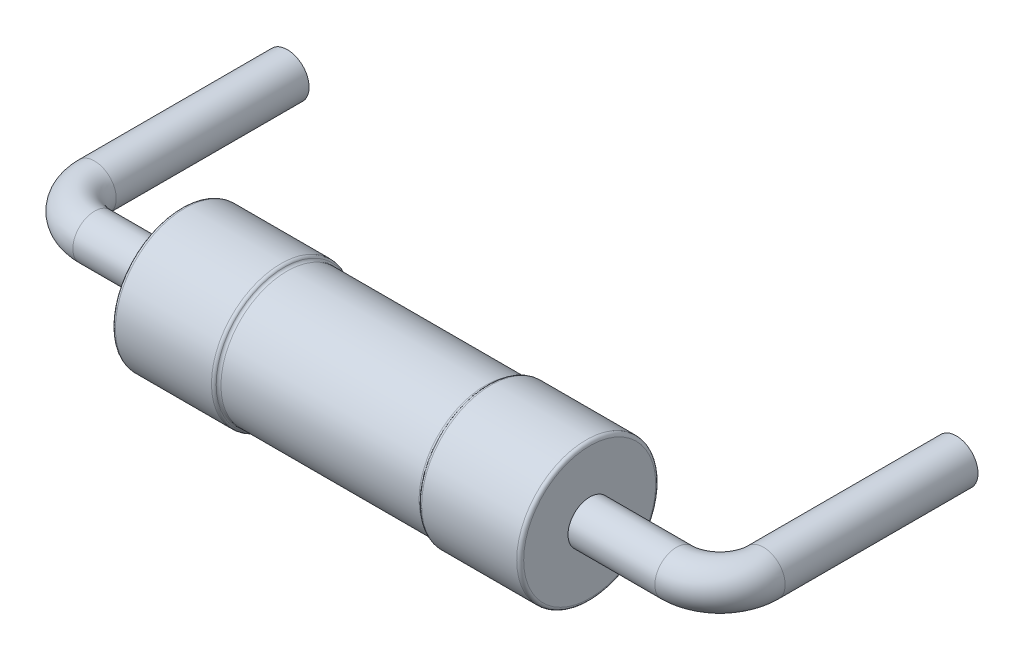
ISO-10303-21;
HEADER;
FILE_DESCRIPTION(('STEP AP214'),'2;1');
FILE_NAME('part.step','',(''),(''),'','','');
FILE_SCHEMA(('AUTOMOTIVE_DESIGN { 1 0 10303 214 1 1 1 1 }'));
ENDSEC;
DATA;
#1=APPLICATION_CONTEXT('core data for automotive mechanical design processes');
#2=APPLICATION_PROTOCOL_DEFINITION('international standard','automotive_design',2000,#1);
#3=PRODUCT_CONTEXT('',#1,'mechanical');
#4=PRODUCT('Part','Part','',(#3));
#5=PRODUCT_RELATED_PRODUCT_CATEGORY('part','',(#4));
#6=PRODUCT_DEFINITION_FORMATION('','',#4);
#7=PRODUCT_DEFINITION_CONTEXT('part definition',#1,'design');
#8=PRODUCT_DEFINITION('design','',#6,#7);
#9=PRODUCT_DEFINITION_SHAPE('','',#8);
#10=(LENGTH_UNIT() NAMED_UNIT(*) SI_UNIT(.MILLI.,.METRE.));
#11=(NAMED_UNIT(*) PLANE_ANGLE_UNIT() SI_UNIT($,.RADIAN.));
#12=(NAMED_UNIT(*) SI_UNIT($,.STERADIAN.) SOLID_ANGLE_UNIT());
#13=UNCERTAINTY_MEASURE_WITH_UNIT(LENGTH_MEASURE(1.E-05),#10,'distance_accuracy_value','');
#14=(GEOMETRIC_REPRESENTATION_CONTEXT(3) GLOBAL_UNCERTAINTY_ASSIGNED_CONTEXT((#13)) GLOBAL_UNIT_ASSIGNED_CONTEXT((#10,
#11,#12)) REPRESENTATION_CONTEXT('',''));
#15=CARTESIAN_POINT('',(0.,0.,0.));
#16=DIRECTION('',(0.,0.,1.));
#17=DIRECTION('',(1.,0.,0.));
#18=AXIS2_PLACEMENT_3D('',#15,#16,#17);
#19=CARTESIAN_POINT('',(3.85,0.,-0.809999999999999));
#20=DIRECTION('',(0.,0.,-1.));
#21=DIRECTION('',(0.,-1.,0.));
#22=AXIS2_PLACEMENT_3D('',#19,#20,#21);
#23=CYLINDRICAL_SURFACE('',#22,0.25);
#24=CARTESIAN_POINT('',(3.85,0.,0.3));
#25=DIRECTION('',(0.,0.,-1.));
#26=DIRECTION('',(0.,-1.,0.));
#27=AXIS2_PLACEMENT_3D('',#24,#25,#26);
#28=CIRCLE('',#27,0.25);
#29=CARTESIAN_POINT('',(4.1,0.,0.3));
#30=VERTEX_POINT('',#29);
#31=EDGE_CURVE('E9',#30,#30,#28,.T.);
#32=ORIENTED_EDGE('',*,*,#31,.T.);
#33=EDGE_LOOP('',(#32));
#34=FACE_BOUND('',#33,.T.);
#35=CARTESIAN_POINT('',(3.85,0.,-1.92));
#36=DIRECTION('',(0.,0.,-1.));
#37=DIRECTION('',(0.,-1.,0.));
#38=AXIS2_PLACEMENT_3D('',#35,#36,#37);
#39=CIRCLE('',#38,0.25);
#40=CARTESIAN_POINT('',(3.85,-0.25,-1.92));
#41=VERTEX_POINT('',#40);
#42=EDGE_CURVE('E22',#41,#41,#39,.T.);
#43=ORIENTED_EDGE('',*,*,#42,.F.);
#44=EDGE_LOOP('',(#43));
#45=FACE_BOUND('',#44,.T.);
#46=ADVANCED_FACE('F14',(#34,#45),#23,.T.);
#47=CARTESIAN_POINT('',(3.85,0.,-1.92));
#48=DIRECTION('',(0.,0.,-1.));
#49=DIRECTION('',(-1.,0.,0.));
#50=AXIS2_PLACEMENT_3D('',#47,#48,#49);
#51=PLANE('',#50);
#52=ORIENTED_EDGE('',*,*,#42,.T.);
#53=EDGE_LOOP('',(#52));
#54=FACE_BOUND('',#53,.T.);
#55=ADVANCED_FACE('F93',(#54),#51,.T.);
#56=CARTESIAN_POINT('',(3.35,0.,0.3));
#57=DIRECTION('',(0.,1.,0.));
#58=DIRECTION('',(1.,0.,0.));
#59=AXIS2_PLACEMENT_3D('',#56,#57,#58);
#60=TOROIDAL_SURFACE('',#59,0.5,0.25);
#61=CARTESIAN_POINT('',(3.35,0.,0.8));
#62=DIRECTION('',(1.,0.,0.));
#63=DIRECTION('',(0.,0.,1.));
#64=AXIS2_PLACEMENT_3D('',#61,#62,#63);
#65=CIRCLE('',#64,0.25);
#66=CARTESIAN_POINT('',(3.35,0.,1.05));
#67=VERTEX_POINT('',#66);
#68=EDGE_CURVE('E27',#67,#67,#65,.T.);
#69=CARTESIAN_POINT('',(3.35,0.,0.3));
#70=DIRECTION('',(0.,1.,0.));
#71=DIRECTION('',(1.,0.,0.));
#72=AXIS2_PLACEMENT_3D('',#69,#70,#71);
#73=CIRCLE('',#72,0.75);
#74=EDGE_CURVE('',#67,#30,#73,.T.);
#75=ORIENTED_EDGE('',*,*,#68,.T.);
#76=ORIENTED_EDGE('',*,*,#31,.F.);
#77=ORIENTED_EDGE('',*,*,#74,.T.);
#78=ORIENTED_EDGE('',*,*,#74,.F.);
#79=EDGE_LOOP('',(#75,#77,#76,#78));
#80=FACE_BOUND('',#79,.T.);
#81=ADVANCED_FACE('F87',(#80),#60,.T.);
#82=CARTESIAN_POINT('',(2.85,0.,0.8));
#83=DIRECTION('',(1.,0.,0.));
#84=DIRECTION('',(0.,0.,1.));
#85=AXIS2_PLACEMENT_3D('',#82,#83,#84);
#86=CYLINDRICAL_SURFACE('',#85,0.25);
#87=CARTESIAN_POINT('',(2.35,0.,0.8));
#88=DIRECTION('',(-1.,0.,0.));
#89=DIRECTION('',(0.,0.,1.));
#90=AXIS2_PLACEMENT_3D('',#87,#88,#89);
#91=CIRCLE('',#90,0.25);
#92=CARTESIAN_POINT('',(2.35,0.,1.05));
#93=VERTEX_POINT('',#92);
#94=EDGE_CURVE('E33',#93,#93,#91,.T.);
#95=ORIENTED_EDGE('',*,*,#94,.F.);
#96=EDGE_LOOP('',(#95));
#97=FACE_BOUND('',#96,.T.);
#98=ORIENTED_EDGE('',*,*,#68,.F.);
#99=EDGE_LOOP('',(#98));
#100=FACE_BOUND('',#99,.T.);
#101=ADVANCED_FACE('F83',(#97,#100),#86,.T.);
#102=CARTESIAN_POINT('',(-3.85,0.,-0.81));
#103=DIRECTION('',(0.,0.,1.));
#104=DIRECTION('',(1.,0.,0.));
#105=AXIS2_PLACEMENT_3D('',#102,#103,#104);
#106=CYLINDRICAL_SURFACE('',#105,0.25);
#107=CARTESIAN_POINT('',(-3.85,0.,-1.92));
#108=DIRECTION('',(0.,0.,1.));
#109=DIRECTION('',(1.,0.,0.));
#110=AXIS2_PLACEMENT_3D('',#107,#108,#109);
#111=CIRCLE('',#110,0.25);
#112=CARTESIAN_POINT('',(-3.6,0.,-1.92));
#113=VERTEX_POINT('',#112);
#114=EDGE_CURVE('E32',#113,#113,#111,.T.);
#115=ORIENTED_EDGE('',*,*,#114,.T.);
#116=EDGE_LOOP('',(#115));
#117=FACE_BOUND('',#116,.T.);
#118=CARTESIAN_POINT('',(-3.85,0.,0.3));
#119=DIRECTION('',(0.,0.,1.));
#120=DIRECTION('',(1.,0.,0.));
#121=AXIS2_PLACEMENT_3D('',#118,#119,#120);
#122=CIRCLE('',#121,0.25);
#123=CARTESIAN_POINT('',(-4.1,0.,0.3));
#124=VERTEX_POINT('',#123);
#125=EDGE_CURVE('E39',#124,#124,#122,.T.);
#126=ORIENTED_EDGE('',*,*,#125,.F.);
#127=EDGE_LOOP('',(#126));
#128=FACE_BOUND('',#127,.T.);
#129=ADVANCED_FACE('F86',(#117,#128),#106,.T.);
#130=CARTESIAN_POINT('',(-3.85,0.,-1.92));
#131=DIRECTION('',(0.,0.,1.));
#132=DIRECTION('',(1.,0.,0.));
#133=AXIS2_PLACEMENT_3D('',#130,#131,#132);
#134=PLANE('',#133);
#135=ORIENTED_EDGE('',*,*,#114,.F.);
#136=EDGE_LOOP('',(#135));
#137=FACE_BOUND('',#136,.T.);
#138=ADVANCED_FACE('F110',(#137),#134,.F.);
#139=CARTESIAN_POINT('',(-3.35,0.,0.3));
#140=DIRECTION('',(0.,1.,0.));
#141=DIRECTION('',(1.,0.,0.));
#142=AXIS2_PLACEMENT_3D('',#139,#140,#141);
#143=TOROIDAL_SURFACE('',#142,0.5,0.25);
#144=CARTESIAN_POINT('',(-3.35,0.,0.8));
#145=DIRECTION('',(1.,0.,0.));
#146=DIRECTION('',(0.,0.,1.));
#147=AXIS2_PLACEMENT_3D('',#144,#145,#146);
#148=CIRCLE('',#147,0.25);
#149=CARTESIAN_POINT('',(-3.35,0.,1.05));
#150=VERTEX_POINT('',#149);
#151=EDGE_CURVE('E42',#150,#150,#148,.T.);
#152=CARTESIAN_POINT('',(-3.35,0.,0.3));
#153=DIRECTION('',(0.,1.,0.));
#154=DIRECTION('',(1.,0.,0.));
#155=AXIS2_PLACEMENT_3D('',#152,#153,#154);
#156=CIRCLE('',#155,0.75);
#157=EDGE_CURVE('',#124,#150,#156,.T.);
#158=ORIENTED_EDGE('',*,*,#125,.T.);
#159=ORIENTED_EDGE('',*,*,#151,.F.);
#160=ORIENTED_EDGE('',*,*,#157,.T.);
#161=ORIENTED_EDGE('',*,*,#157,.F.);
#162=EDGE_LOOP('',(#158,#160,#159,#161));
#163=FACE_BOUND('',#162,.T.);
#164=ADVANCED_FACE('F117',(#163),#143,.T.);
#165=CARTESIAN_POINT('',(-2.85,0.,0.8));
#166=DIRECTION('',(1.,0.,0.));
#167=DIRECTION('',(0.,0.,1.));
#168=AXIS2_PLACEMENT_3D('',#165,#166,#167);
#169=CYLINDRICAL_SURFACE('',#168,0.25);
#170=ORIENTED_EDGE('',*,*,#151,.T.);
#171=EDGE_LOOP('',(#170));
#172=FACE_BOUND('',#171,.T.);
#173=CARTESIAN_POINT('',(-2.35,0.,0.8));
#174=DIRECTION('',(1.,0.,0.));
#175=DIRECTION('',(0.,0.,1.));
#176=AXIS2_PLACEMENT_3D('',#173,#174,#175);
#177=CIRCLE('',#176,0.25);
#178=CARTESIAN_POINT('',(-2.35,0.,1.05));
#179=VERTEX_POINT('',#178);
#180=EDGE_CURVE('E46',#179,#179,#177,.T.);
#181=ORIENTED_EDGE('',*,*,#180,.F.);
#182=EDGE_LOOP('',(#181));
#183=FACE_BOUND('',#182,.T.);
#184=ADVANCED_FACE('F113',(#172,#183),#169,.T.);
#185=CARTESIAN_POINT('',(-1.20428203230276,0.,0.8));
#186=DIRECTION('',(1.,0.,0.));
#187=DIRECTION('',(0.,0.,1.));
#188=AXIS2_PLACEMENT_3D('',#185,#186,#187);
#189=TOROIDAL_SURFACE('',#188,0.76,0.04);
#190=CARTESIAN_POINT('',(-1.20428203230276,0.,0.8));
#191=DIRECTION('',(1.,0.,0.));
#192=DIRECTION('',(0.,0.,1.));
#193=AXIS2_PLACEMENT_3D('',#190,#191,#192);
#194=CIRCLE('',#193,0.8);
#195=CARTESIAN_POINT('',(-1.20428203230276,0.,1.6));
#196=VERTEX_POINT('',#195);
#197=EDGE_CURVE('E45',#196,#196,#194,.T.);
#198=ORIENTED_EDGE('',*,*,#197,.T.);
#199=EDGE_LOOP('',(#198));
#200=FACE_BOUND('',#199,.T.);
#201=CARTESIAN_POINT('',(-1.16964101615138,0.,0.8));
#202=DIRECTION('',(-1.,0.,0.));
#203=DIRECTION('',(0.,0.,1.));
#204=AXIS2_PLACEMENT_3D('',#201,#202,#203);
#205=CIRCLE('',#204,0.78);
#206=CARTESIAN_POINT('',(-1.16964101615138,0.,1.58));
#207=VERTEX_POINT('',#206);
#208=EDGE_CURVE('E53',#207,#207,#205,.T.);
#209=ORIENTED_EDGE('',*,*,#208,.T.);
#210=EDGE_LOOP('',(#209));
#211=FACE_BOUND('',#210,.T.);
#212=ADVANCED_FACE('F116',(#200,#211),#189,.T.);
#213=CARTESIAN_POINT('',(-1.7625,0.,0.8));
#214=DIRECTION('',(1.,0.,0.));
#215=DIRECTION('',(0.,0.,1.));
#216=AXIS2_PLACEMENT_3D('',#213,#214,#215);
#217=CYLINDRICAL_SURFACE('',#216,0.8);
#218=CARTESIAN_POINT('',(-2.31,0.,0.8));
#219=DIRECTION('',(-1.,0.,0.));
#220=DIRECTION('',(0.,0.,1.));
#221=AXIS2_PLACEMENT_3D('',#218,#219,#220);
#222=CIRCLE('',#221,0.8);
#223=CARTESIAN_POINT('',(-2.31,0.,1.6));
#224=VERTEX_POINT('',#223);
#225=EDGE_CURVE('E56',#224,#224,#222,.T.);
#226=ORIENTED_EDGE('',*,*,#225,.F.);
#227=EDGE_LOOP('',(#226));
#228=FACE_BOUND('',#227,.T.);
#229=ORIENTED_EDGE('',*,*,#197,.F.);
#230=EDGE_LOOP('',(#229));
#231=FACE_BOUND('',#230,.T.);
#232=ADVANCED_FACE('F119',(#228,#231),#217,.T.);
#233=CARTESIAN_POINT('',(-2.31,0.,0.8));
#234=DIRECTION('',(-1.,0.,0.));
#235=DIRECTION('',(0.,0.,1.));
#236=AXIS2_PLACEMENT_3D('',#233,#234,#235);
#237=TOROIDAL_SURFACE('',#236,0.76,0.04);
#238=ORIENTED_EDGE('',*,*,#225,.T.);
#239=EDGE_LOOP('',(#238));
#240=FACE_BOUND('',#239,.T.);
#241=CARTESIAN_POINT('',(-2.35,0.,0.8));
#242=DIRECTION('',(1.,0.,0.));
#243=DIRECTION('',(0.,0.,1.));
#244=AXIS2_PLACEMENT_3D('',#241,#242,#243);
#245=CIRCLE('',#244,0.76);
#246=CARTESIAN_POINT('',(-2.35,0.,1.56));
#247=VERTEX_POINT('',#246);
#248=EDGE_CURVE('E49',#247,#247,#245,.T.);
#249=ORIENTED_EDGE('',*,*,#248,.T.);
#250=EDGE_LOOP('',(#249));
#251=FACE_BOUND('',#250,.T.);
#252=ADVANCED_FACE('F121',(#240,#251),#237,.T.);
#253=CARTESIAN_POINT('',(-2.35,0.,0.8));
#254=DIRECTION('',(-1.,0.,0.));
#255=DIRECTION('',(0.,0.,1.));
#256=AXIS2_PLACEMENT_3D('',#253,#254,#255);
#257=PLANE('',#256);
#258=ORIENTED_EDGE('',*,*,#248,.F.);
#259=EDGE_LOOP('',(#258));
#260=FACE_BOUND('',#259,.T.);
#261=ORIENTED_EDGE('',*,*,#180,.T.);
#262=EDGE_LOOP('',(#261));
#263=FACE_BOUND('',#262,.T.);
#264=ADVANCED_FACE('F134',(#260,#263),#257,.T.);
#265=CARTESIAN_POINT('',(1.14571796769725,0.,0.8));
#266=DIRECTION('',(1.,0.,0.));
#267=DIRECTION('',(0.,0.,1.));
#268=AXIS2_PLACEMENT_3D('',#265,#266,#267);
#269=TOROIDAL_SURFACE('',#268,0.8,0.04);
#270=CARTESIAN_POINT('',(1.14571796769725,0.,0.8));
#271=DIRECTION('',(1.,0.,0.));
#272=DIRECTION('',(0.,0.,1.));
#273=AXIS2_PLACEMENT_3D('',#270,#271,#272);
#274=CIRCLE('',#273,0.76);
#275=CARTESIAN_POINT('',(1.14571796769725,0.,1.56));
#276=VERTEX_POINT('',#275);
#277=EDGE_CURVE('E50',#276,#276,#274,.T.);
#278=ORIENTED_EDGE('',*,*,#277,.T.);
#279=EDGE_LOOP('',(#278));
#280=FACE_BOUND('',#279,.T.);
#281=CARTESIAN_POINT('',(1.18035898384862,0.,0.8));
#282=DIRECTION('',(-1.,0.,0.));
#283=DIRECTION('',(0.,0.,1.));
#284=AXIS2_PLACEMENT_3D('',#281,#282,#283);
#285=CIRCLE('',#284,0.78);
#286=CARTESIAN_POINT('',(1.18035898384862,0.,1.58));
#287=VERTEX_POINT('',#286);
#288=EDGE_CURVE('E63',#287,#287,#285,.T.);
#289=ORIENTED_EDGE('',*,*,#288,.T.);
#290=EDGE_LOOP('',(#289));
#291=FACE_BOUND('',#290,.T.);
#292=ADVANCED_FACE('F126',(#280,#291),#269,.F.);
#293=CARTESIAN_POINT('',(0.,0.,0.8));
#294=DIRECTION('',(1.,0.,0.));
#295=DIRECTION('',(0.,0.,1.));
#296=AXIS2_PLACEMENT_3D('',#293,#294,#295);
#297=CYLINDRICAL_SURFACE('',#296,0.76);
#298=CARTESIAN_POINT('',(-1.135,0.,0.8));
#299=DIRECTION('',(-1.,0.,0.));
#300=DIRECTION('',(0.,0.,1.));
#301=AXIS2_PLACEMENT_3D('',#298,#299,#300);
#302=CIRCLE('',#301,0.76);
#303=CARTESIAN_POINT('',(-1.135,0.,1.56));
#304=VERTEX_POINT('',#303);
#305=EDGE_CURVE('E66',#304,#304,#302,.T.);
#306=ORIENTED_EDGE('',*,*,#305,.F.);
#307=EDGE_LOOP('',(#306));
#308=FACE_BOUND('',#307,.T.);
#309=ORIENTED_EDGE('',*,*,#277,.F.);
#310=EDGE_LOOP('',(#309));
#311=FACE_BOUND('',#310,.T.);
#312=ADVANCED_FACE('F123',(#308,#311),#297,.T.);
#313=CARTESIAN_POINT('',(-1.135,0.,0.8));
#314=DIRECTION('',(-1.,0.,0.));
#315=DIRECTION('',(0.,0.,1.));
#316=AXIS2_PLACEMENT_3D('',#313,#314,#315);
#317=TOROIDAL_SURFACE('',#316,0.8,0.04);
#318=ORIENTED_EDGE('',*,*,#305,.T.);
#319=EDGE_LOOP('',(#318));
#320=FACE_BOUND('',#319,.T.);
#321=ORIENTED_EDGE('',*,*,#208,.F.);
#322=EDGE_LOOP('',(#321));
#323=FACE_BOUND('',#322,.T.);
#324=ADVANCED_FACE('F125',(#320,#323),#317,.F.);
#325=CARTESIAN_POINT('',(2.31,0.,0.8));
#326=DIRECTION('',(1.,0.,0.));
#327=DIRECTION('',(0.,0.,1.));
#328=AXIS2_PLACEMENT_3D('',#325,#326,#327);
#329=TOROIDAL_SURFACE('',#328,0.76,0.04);
#330=CARTESIAN_POINT('',(2.31,0.,0.8));
#331=DIRECTION('',(1.,0.,0.));
#332=DIRECTION('',(0.,0.,1.));
#333=AXIS2_PLACEMENT_3D('',#330,#331,#332);
#334=CIRCLE('',#333,0.8);
#335=CARTESIAN_POINT('',(2.31,0.,1.6));
#336=VERTEX_POINT('',#335);
#337=EDGE_CURVE('E69',#336,#336,#334,.T.);
#338=ORIENTED_EDGE('',*,*,#337,.T.);
#339=EDGE_LOOP('',(#338));
#340=FACE_BOUND('',#339,.T.);
#341=CARTESIAN_POINT('',(2.35,0.,0.8));
#342=DIRECTION('',(-1.,0.,0.));
#343=DIRECTION('',(0.,0.,1.));
#344=AXIS2_PLACEMENT_3D('',#341,#342,#343);
#345=CIRCLE('',#344,0.76);
#346=CARTESIAN_POINT('',(2.35,0.,1.56));
#347=VERTEX_POINT('',#346);
#348=EDGE_CURVE('E36',#347,#347,#345,.T.);
#349=ORIENTED_EDGE('',*,*,#348,.T.);
#350=EDGE_LOOP('',(#349));
#351=FACE_BOUND('',#350,.T.);
#352=ADVANCED_FACE('F74',(#340,#351),#329,.T.);
#353=CARTESIAN_POINT('',(1.7625,0.,0.8));
#354=DIRECTION('',(1.,0.,0.));
#355=DIRECTION('',(0.,0.,1.));
#356=AXIS2_PLACEMENT_3D('',#353,#354,#355);
#357=CYLINDRICAL_SURFACE('',#356,0.8);
#358=CARTESIAN_POINT('',(1.215,0.,0.8));
#359=DIRECTION('',(-1.,0.,0.));
#360=DIRECTION('',(0.,0.,1.));
#361=AXIS2_PLACEMENT_3D('',#358,#359,#360);
#362=CIRCLE('',#361,0.8);
#363=CARTESIAN_POINT('',(1.215,0.,1.6));
#364=VERTEX_POINT('',#363);
#365=EDGE_CURVE('E18',#364,#364,#362,.T.);
#366=ORIENTED_EDGE('',*,*,#365,.F.);
#367=EDGE_LOOP('',(#366));
#368=FACE_BOUND('',#367,.T.);
#369=ORIENTED_EDGE('',*,*,#337,.F.);
#370=EDGE_LOOP('',(#369));
#371=FACE_BOUND('',#370,.T.);
#372=ADVANCED_FACE('F16',(#368,#371),#357,.T.);
#373=CARTESIAN_POINT('',(2.35,0.,0.8));
#374=DIRECTION('',(1.,0.,0.));
#375=DIRECTION('',(0.,0.,-1.));
#376=AXIS2_PLACEMENT_3D('',#373,#374,#375);
#377=PLANE('',#376);
#378=ORIENTED_EDGE('',*,*,#348,.F.);
#379=EDGE_LOOP('',(#378));
#380=FACE_BOUND('',#379,.T.);
#381=ORIENTED_EDGE('',*,*,#94,.T.);
#382=EDGE_LOOP('',(#381));
#383=FACE_BOUND('',#382,.T.);
#384=ADVANCED_FACE('F76',(#380,#383),#377,.T.);
#385=CARTESIAN_POINT('',(1.215,0.,0.8));
#386=DIRECTION('',(-1.,0.,0.));
#387=DIRECTION('',(0.,0.,1.));
#388=AXIS2_PLACEMENT_3D('',#385,#386,#387);
#389=TOROIDAL_SURFACE('',#388,0.76,0.04);
#390=ORIENTED_EDGE('',*,*,#365,.T.);
#391=EDGE_LOOP('',(#390));
#392=FACE_BOUND('',#391,.T.);
#393=ORIENTED_EDGE('',*,*,#288,.F.);
#394=EDGE_LOOP('',(#393));
#395=FACE_BOUND('',#394,.T.);
#396=ADVANCED_FACE('F79',(#392,#395),#389,.T.);
#397=CLOSED_SHELL('',(#46,#55,#81,#101,#129,#138,#164,#184,#212,#232,#252,#264,#292,#312,#324,
#352,#372,#384,#396));
#398=MANIFOLD_SOLID_BREP('B1',#397);
#399=ADVANCED_BREP_SHAPE_REPRESENTATION('',(#18,#398),#14);
#400=SHAPE_DEFINITION_REPRESENTATION(#9,#399);
ENDSEC;
END-ISO-10303-21;
